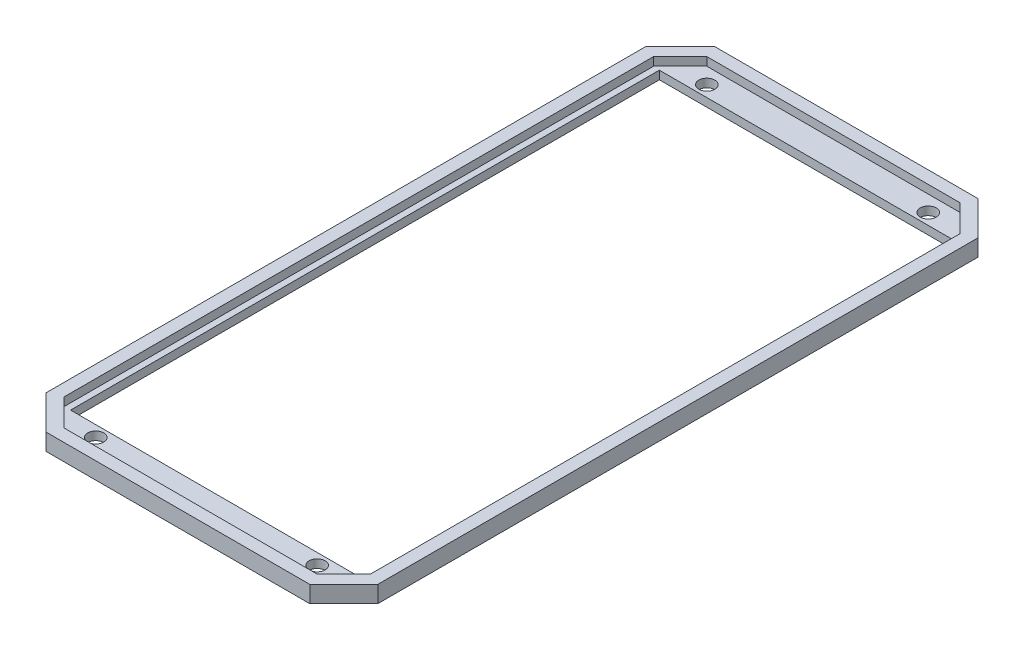
ISO-10303-21;
HEADER;
FILE_DESCRIPTION(('STEP AP214'),'2;1');
FILE_NAME('part.step','',(''),(''),'','','');
FILE_SCHEMA(('AUTOMOTIVE_DESIGN { 1 0 10303 214 1 1 1 1 }'));
ENDSEC;
DATA;
#1=APPLICATION_CONTEXT('core data for automotive mechanical design processes');
#2=APPLICATION_PROTOCOL_DEFINITION('international standard','automotive_design',2000,#1);
#3=PRODUCT_CONTEXT('',#1,'mechanical');
#4=PRODUCT('Part','Part','',(#3));
#5=PRODUCT_RELATED_PRODUCT_CATEGORY('part','',(#4));
#6=PRODUCT_DEFINITION_FORMATION('','',#4);
#7=PRODUCT_DEFINITION_CONTEXT('part definition',#1,'design');
#8=PRODUCT_DEFINITION('design','',#6,#7);
#9=PRODUCT_DEFINITION_SHAPE('','',#8);
#10=(LENGTH_UNIT() NAMED_UNIT(*) SI_UNIT(.MILLI.,.METRE.));
#11=(NAMED_UNIT(*) PLANE_ANGLE_UNIT() SI_UNIT($,.RADIAN.));
#12=(NAMED_UNIT(*) SI_UNIT($,.STERADIAN.) SOLID_ANGLE_UNIT());
#13=UNCERTAINTY_MEASURE_WITH_UNIT(LENGTH_MEASURE(1.E-05),#10,'distance_accuracy_value','');
#14=(GEOMETRIC_REPRESENTATION_CONTEXT(3) GLOBAL_UNCERTAINTY_ASSIGNED_CONTEXT((#13)) GLOBAL_UNIT_ASSIGNED_CONTEXT((#10,
#11,#12)) REPRESENTATION_CONTEXT('',''));
#15=CARTESIAN_POINT('',(0.,0.,0.));
#16=DIRECTION('',(0.,0.,1.));
#17=DIRECTION('',(1.,0.,0.));
#18=AXIS2_PLACEMENT_3D('',#15,#16,#17);
#19=CARTESIAN_POINT('',(-23.6494201824343,2.,15.549982511152));
#20=DIRECTION('',(-1.,0.,0.));
#21=DIRECTION('',(0.,0.,1.));
#22=AXIS2_PLACEMENT_3D('',#19,#20,#21);
#23=PLANE('',#22);
#24=DIRECTION('',(0.,0.,-1.));
#25=VECTOR('',#24,1.);
#26=CARTESIAN_POINT('',(-23.6494201824343,0.,15.549982511152));
#27=LINE('',#26,#25);
#28=CARTESIAN_POINT('',(-23.6494201824343,0.,85.7901944077587));
#29=VERTEX_POINT('',#28);
#30=CARTESIAN_POINT('',(-23.6494201824343,0.,-54.6831675743825));
#31=VERTEX_POINT('',#30);
#32=EDGE_CURVE('E317',#29,#31,#27,.T.);
#33=ORIENTED_EDGE('',*,*,#32,.F.);
#34=DIRECTION('',(0.,-1.,0.));
#35=VECTOR('',#34,1.);
#36=CARTESIAN_POINT('',(-23.6494201824343,2.,85.7901944077587));
#37=LINE('',#36,#35);
#38=CARTESIAN_POINT('',(-23.6494201824343,2.,85.7901944077587));
#39=VERTEX_POINT('',#38);
#40=EDGE_CURVE('E11',#39,#29,#37,.T.);
#41=ORIENTED_EDGE('',*,*,#40,.F.);
#42=DIRECTION('',(0.,0.,-1.));
#43=VECTOR('',#42,1.);
#44=CARTESIAN_POINT('',(-23.6494201824343,2.,15.549982511152));
#45=LINE('',#44,#43);
#46=CARTESIAN_POINT('',(-23.6494201824343,2.,-54.6831675743825));
#47=VERTEX_POINT('',#46);
#48=EDGE_CURVE('E277',#39,#47,#45,.T.);
#49=ORIENTED_EDGE('',*,*,#48,.T.);
#50=DIRECTION('',(0.,-1.,0.));
#51=VECTOR('',#50,1.);
#52=CARTESIAN_POINT('',(-23.6494201824343,2.,-54.6831675743825));
#53=LINE('',#52,#51);
#54=EDGE_CURVE('E334',#47,#31,#53,.T.);
#55=ORIENTED_EDGE('',*,*,#54,.T.);
#56=EDGE_LOOP('',(#33,#41,#49,#55));
#57=FACE_BOUND('',#56,.T.);
#58=ADVANCED_FACE('F32',(#57),#23,.T.);
#59=CARTESIAN_POINT('',(-197.311283367731,2.,85.7901944077588));
#60=DIRECTION('',(0.,0.,-1.));
#61=DIRECTION('',(-1.,0.,0.));
#62=AXIS2_PLACEMENT_3D('',#59,#60,#61);
#63=PLANE('',#62);
#64=DIRECTION('',(1.,0.,0.));
#65=VECTOR('',#64,1.);
#66=CARTESIAN_POINT('',(-197.311283367731,0.,85.7901944077588));
#67=LINE('',#66,#65);
#68=CARTESIAN_POINT('',(-93.8014202016012,0.,85.7901944077587));
#69=VERTEX_POINT('',#68);
#70=EDGE_CURVE('E320',#69,#29,#67,.T.);
#71=ORIENTED_EDGE('',*,*,#70,.F.);
#72=DIRECTION('',(0.,-1.,0.));
#73=VECTOR('',#72,1.);
#74=CARTESIAN_POINT('',(-93.8014202016012,2.,85.7901944077587));
#75=LINE('',#74,#73);
#76=CARTESIAN_POINT('',(-93.8014202016012,2.,85.7901944077587));
#77=VERTEX_POINT('',#76);
#78=EDGE_CURVE('E41',#77,#69,#75,.T.);
#79=ORIENTED_EDGE('',*,*,#78,.F.);
#80=DIRECTION('',(1.,0.,0.));
#81=VECTOR('',#80,1.);
#82=CARTESIAN_POINT('',(-197.311283367731,2.,85.7901944077588));
#83=LINE('',#82,#81);
#84=EDGE_CURVE('E280',#77,#39,#83,.T.);
#85=ORIENTED_EDGE('',*,*,#84,.T.);
#86=ORIENTED_EDGE('',*,*,#40,.T.);
#87=EDGE_LOOP('',(#71,#79,#85,#86));
#88=FACE_BOUND('',#87,.T.);
#89=ADVANCED_FACE('F406',(#88),#63,.T.);
#90=CARTESIAN_POINT('',(-93.8014202016012,2.,15.549982511152));
#91=DIRECTION('',(1.,0.,0.));
#92=DIRECTION('',(0.,0.,-1.));
#93=AXIS2_PLACEMENT_3D('',#90,#91,#92);
#94=PLANE('',#93);
#95=DIRECTION('',(0.,0.,1.));
#96=VECTOR('',#95,1.);
#97=CARTESIAN_POINT('',(-93.8014202016012,0.,15.549982511152));
#98=LINE('',#97,#96);
#99=CARTESIAN_POINT('',(-93.8014202016013,0.,-54.6831675743825));
#100=VERTEX_POINT('',#99);
#101=EDGE_CURVE('E323',#100,#69,#98,.T.);
#102=ORIENTED_EDGE('',*,*,#101,.F.);
#103=DIRECTION('',(0.,-1.,0.));
#104=VECTOR('',#103,1.);
#105=CARTESIAN_POINT('',(-93.8014202016013,2.,-54.6831675743825));
#106=LINE('',#105,#104);
#107=CARTESIAN_POINT('',(-93.8014202016013,2.,-54.6831675743825));
#108=VERTEX_POINT('',#107);
#109=EDGE_CURVE('E336',#108,#100,#106,.T.);
#110=ORIENTED_EDGE('',*,*,#109,.F.);
#111=DIRECTION('',(0.,0.,1.));
#112=VECTOR('',#111,1.);
#113=CARTESIAN_POINT('',(-93.8014202016012,2.,15.549982511152));
#114=LINE('',#113,#112);
#115=EDGE_CURVE('E283',#108,#77,#114,.T.);
#116=ORIENTED_EDGE('',*,*,#115,.T.);
#117=ORIENTED_EDGE('',*,*,#78,.T.);
#118=EDGE_LOOP('',(#102,#110,#116,#117));
#119=FACE_BOUND('',#118,.T.);
#120=ADVANCED_FACE('F412',(#119),#94,.T.);
#121=CARTESIAN_POINT('',(-197.311283367732,2.,-64.1615696298493));
#122=DIRECTION('',(0.,0.,1.));
#123=DIRECTION('',(1.,0.,0.));
#124=AXIS2_PLACEMENT_3D('',#121,#122,#123);
#125=PLANE('',#124);
#126=DIRECTION('',(-1.,0.,0.));
#127=VECTOR('',#126,1.);
#128=CARTESIAN_POINT('',(-197.311283367732,0.,-64.1615696298493));
#129=LINE('',#128,#127);
#130=CARTESIAN_POINT('',(-27.2567690802144,0.,-64.1615696298495));
#131=VERTEX_POINT('',#130);
#132=CARTESIAN_POINT('',(-90.1940659774526,0.,-64.1615696298494));
#133=VERTEX_POINT('',#132);
#134=EDGE_CURVE('E269',#131,#133,#129,.T.);
#135=ORIENTED_EDGE('',*,*,#134,.T.);
#136=DIRECTION('',(0.,-1.,0.));
#137=VECTOR('',#136,1.);
#138=CARTESIAN_POINT('',(-90.1940659774526,2.,-64.1615696298494));
#139=LINE('',#138,#137);
#140=CARTESIAN_POINT('',(-90.1940659774526,4.,-64.1615696298494));
#141=VERTEX_POINT('',#140);
#142=EDGE_CURVE('E36',#141,#133,#139,.T.);
#143=ORIENTED_EDGE('',*,*,#142,.F.);
#144=DIRECTION('',(-1.,0.,0.));
#145=VECTOR('',#144,1.);
#146=CARTESIAN_POINT('',(-197.311283367732,4.,-64.1615696298493));
#147=LINE('',#146,#145);
#148=CARTESIAN_POINT('',(-27.2567690802144,4.,-64.1615696298495));
#149=VERTEX_POINT('',#148);
#150=EDGE_CURVE('E210',#149,#141,#147,.T.);
#151=ORIENTED_EDGE('',*,*,#150,.F.);
#152=DIRECTION('',(0.,-1.,0.));
#153=VECTOR('',#152,1.);
#154=CARTESIAN_POINT('',(-27.2567690802144,2.,-64.1615696298495));
#155=LINE('',#154,#153);
#156=EDGE_CURVE('E294',#149,#131,#155,.T.);
#157=ORIENTED_EDGE('',*,*,#156,.T.);
#158=EDGE_LOOP('',(#135,#143,#151,#157));
#159=FACE_BOUND('',#158,.T.);
#160=ADVANCED_FACE('F34',(#159),#125,.F.);
#161=CARTESIAN_POINT('',(-183.561472634612,2.,29.2877420243397));
#162=DIRECTION('',(0.707416726024313,0.,0.706796700431632));
#163=DIRECTION('',(0.706796700431632,0.,-0.707416726024313));
#164=AXIS2_PLACEMENT_3D('',#161,#162,#163);
#165=PLANE('',#164);
#166=DIRECTION('',(-0.706796700431632,0.,0.707416726024313));
#167=VECTOR('',#166,1.);
#168=CARTESIAN_POINT('',(-183.561472634612,0.,29.2877420243397));
#169=LINE('',#168,#167);
#170=CARTESIAN_POINT('',(-98.3014227032664,0.,-56.0471008608471));
#171=VERTEX_POINT('',#170);
#172=EDGE_CURVE('E297',#133,#171,#169,.T.);
#173=ORIENTED_EDGE('',*,*,#172,.T.);
#174=DIRECTION('',(0.,-1.,0.));
#175=VECTOR('',#174,1.);
#176=CARTESIAN_POINT('',(-98.3014227032664,2.,-56.0471008608471));
#177=LINE('',#176,#175);
#178=CARTESIAN_POINT('',(-98.3014227032664,4.,-56.0471008608471));
#179=VERTEX_POINT('',#178);
#180=EDGE_CURVE('E355',#179,#171,#177,.T.);
#181=ORIENTED_EDGE('',*,*,#180,.F.);
#182=DIRECTION('',(-0.706796700431632,0.,0.707416726024313));
#183=VECTOR('',#182,1.);
#184=CARTESIAN_POINT('',(-183.561472634612,4.,29.2877420243397));
#185=LINE('',#184,#183);
#186=EDGE_CURVE('E213',#141,#179,#185,.T.);
#187=ORIENTED_EDGE('',*,*,#186,.F.);
#188=ORIENTED_EDGE('',*,*,#142,.T.);
#189=EDGE_LOOP('',(#173,#181,#187,#188));
#190=FACE_BOUND('',#189,.T.);
#191=ADVANCED_FACE('F363',(#190),#165,.F.);
#192=CARTESIAN_POINT('',(-98.3014227032664,2.,15.549982511152));
#193=DIRECTION('',(1.,0.,0.));
#194=DIRECTION('',(0.,0.,-1.));
#195=AXIS2_PLACEMENT_3D('',#192,#193,#194);
#196=PLANE('',#195);
#197=DIRECTION('',(0.,0.,1.));
#198=VECTOR('',#197,1.);
#199=CARTESIAN_POINT('',(-98.3014227032664,0.,15.549982511152));
#200=LINE('',#199,#198);
#201=CARTESIAN_POINT('',(-98.3014227032664,0.,87.1541805133933));
#202=VERTEX_POINT('',#201);
#203=EDGE_CURVE('E299',#171,#202,#200,.T.);
#204=ORIENTED_EDGE('',*,*,#203,.T.);
#205=DIRECTION('',(0.,-1.,0.));
#206=VECTOR('',#205,1.);
#207=CARTESIAN_POINT('',(-98.3014227032664,2.,87.1541805133933));
#208=LINE('',#207,#206);
#209=CARTESIAN_POINT('',(-98.3014227032664,4.,87.1541805133933));
#210=VERTEX_POINT('',#209);
#211=EDGE_CURVE('E353',#210,#202,#208,.T.);
#212=ORIENTED_EDGE('',*,*,#211,.F.);
#213=DIRECTION('',(0.,0.,1.));
#214=VECTOR('',#213,1.);
#215=CARTESIAN_POINT('',(-98.3014227032664,4.,15.549982511152));
#216=LINE('',#215,#214);
#217=EDGE_CURVE('E216',#179,#210,#216,.T.);
#218=ORIENTED_EDGE('',*,*,#217,.F.);
#219=ORIENTED_EDGE('',*,*,#180,.T.);
#220=EDGE_LOOP('',(#204,#212,#218,#219));
#221=FACE_BOUND('',#220,.T.);
#222=ADVANCED_FACE('F373',(#221),#196,.F.);
#223=CARTESIAN_POINT('',(-183.608515224739,2.,1.84719687791989));
#224=DIRECTION('',(0.707106329910458,0.,-0.707107232462349));
#225=DIRECTION('',(-0.707107232462349,0.,-0.707106329910458));
#226=AXIS2_PLACEMENT_3D('',#223,#224,#225);
#227=PLANE('',#226);
#228=DIRECTION('',(0.707107232462349,0.,0.707106329910458));
#229=VECTOR('',#228,1.);
#230=CARTESIAN_POINT('',(-183.608515224739,0.,1.84719687791989));
#231=LINE('',#230,#229);
#232=CARTESIAN_POINT('',(-90.1940582162637,0.,95.2615346521534));
#233=VERTEX_POINT('',#232);
#234=EDGE_CURVE('E301',#202,#233,#231,.T.);
#235=ORIENTED_EDGE('',*,*,#234,.T.);
#236=DIRECTION('',(0.,-1.,0.));
#237=VECTOR('',#236,1.);
#238=CARTESIAN_POINT('',(-90.1940582162637,2.,95.2615346521534));
#239=LINE('',#238,#237);
#240=CARTESIAN_POINT('',(-90.1940582162637,4.,95.2615346521534));
#241=VERTEX_POINT('',#240);
#242=EDGE_CURVE('E350',#241,#233,#239,.T.);
#243=ORIENTED_EDGE('',*,*,#242,.F.);
#244=DIRECTION('',(0.707107232462349,0.,0.707106329910458));
#245=VECTOR('',#244,1.);
#246=CARTESIAN_POINT('',(-183.608515224739,4.,1.84719687791989));
#247=LINE('',#246,#245);
#248=EDGE_CURVE('E219',#210,#241,#247,.T.);
#249=ORIENTED_EDGE('',*,*,#248,.F.);
#250=ORIENTED_EDGE('',*,*,#211,.T.);
#251=EDGE_LOOP('',(#235,#243,#249,#250));
#252=FACE_BOUND('',#251,.T.);
#253=ADVANCED_FACE('F376',(#252),#227,.F.);
#254=CARTESIAN_POINT('',(-197.311283367731,2.,95.2615346521535));
#255=DIRECTION('',(0.,0.,-1.));
#256=DIRECTION('',(-1.,0.,0.));
#257=AXIS2_PLACEMENT_3D('',#254,#255,#256);
#258=PLANE('',#257);
#259=DIRECTION('',(1.,0.,0.));
#260=VECTOR('',#259,1.);
#261=CARTESIAN_POINT('',(-197.311283367731,0.,95.2615346521535));
#262=LINE('',#261,#260);
#263=CARTESIAN_POINT('',(-27.2567768418157,0.,95.2615346521534));
#264=VERTEX_POINT('',#263);
#265=EDGE_CURVE('E303',#233,#264,#262,.T.);
#266=ORIENTED_EDGE('',*,*,#265,.T.);
#267=DIRECTION('',(0.,-1.,0.));
#268=VECTOR('',#267,1.);
#269=CARTESIAN_POINT('',(-27.2567768418157,2.,95.2615346521534));
#270=LINE('',#269,#268);
#271=CARTESIAN_POINT('',(-27.2567768418157,4.,95.2615346521534));
#272=VERTEX_POINT('',#271);
#273=EDGE_CURVE('E347',#272,#264,#270,.T.);
#274=ORIENTED_EDGE('',*,*,#273,.F.);
#275=DIRECTION('',(1.,0.,0.));
#276=VECTOR('',#275,1.);
#277=CARTESIAN_POINT('',(-197.311283367731,4.,95.2615346521535));
#278=LINE('',#277,#276);
#279=EDGE_CURVE('E222',#241,#272,#278,.T.);
#280=ORIENTED_EDGE('',*,*,#279,.F.);
#281=ORIENTED_EDGE('',*,*,#242,.T.);
#282=EDGE_LOOP('',(#266,#274,#280,#281));
#283=FACE_BOUND('',#282,.T.);
#284=ADVANCED_FACE('F380',(#283),#258,.F.);
#285=CARTESIAN_POINT('',(-72.4285189262058,2.,140.433136009868));
#286=DIRECTION('',(-0.70710567973446,0.,-0.707107882636919));
#287=DIRECTION('',(-0.707107882636919,0.,0.70710567973446));
#288=AXIS2_PLACEMENT_3D('',#285,#286,#287);
#289=PLANE('',#288);
#290=DIRECTION('',(0.707107882636919,0.,-0.70710567973446));
#291=VECTOR('',#290,1.);
#292=CARTESIAN_POINT('',(-72.4285189262058,0.,140.433136009868));
#293=LINE('',#292,#291);
#294=CARTESIAN_POINT('',(-19.1494175289392,0.,87.1542005966983));
#295=VERTEX_POINT('',#294);
#296=EDGE_CURVE('E305',#264,#295,#293,.T.);
#297=ORIENTED_EDGE('',*,*,#296,.T.);
#298=DIRECTION('',(0.,-1.,0.));
#299=VECTOR('',#298,1.);
#300=CARTESIAN_POINT('',(-19.1494175289392,2.,87.1542005966983));
#301=LINE('',#300,#299);
#302=CARTESIAN_POINT('',(-19.1494175289392,4.,87.1542005966983));
#303=VERTEX_POINT('',#302);
#304=EDGE_CURVE('E344',#303,#295,#301,.T.);
#305=ORIENTED_EDGE('',*,*,#304,.F.);
#306=DIRECTION('',(0.707107882636919,0.,-0.70710567973446));
#307=VECTOR('',#306,1.);
#308=CARTESIAN_POINT('',(-72.4285189262058,4.,140.433136009868));
#309=LINE('',#308,#307);
#310=EDGE_CURVE('E225',#272,#303,#309,.T.);
#311=ORIENTED_EDGE('',*,*,#310,.F.);
#312=ORIENTED_EDGE('',*,*,#273,.T.);
#313=EDGE_LOOP('',(#297,#305,#311,#312));
#314=FACE_BOUND('',#313,.T.);
#315=ADVANCED_FACE('F383',(#314),#289,.F.);
#316=CARTESIAN_POINT('',(-19.1494175289392,2.,15.549982511152));
#317=DIRECTION('',(-1.,0.,0.));
#318=DIRECTION('',(0.,0.,1.));
#319=AXIS2_PLACEMENT_3D('',#316,#317,#318);
#320=PLANE('',#319);
#321=DIRECTION('',(0.,0.,-1.));
#322=VECTOR('',#321,1.);
#323=CARTESIAN_POINT('',(-19.1494175289392,0.,15.549982511152));
#324=LINE('',#323,#322);
#325=CARTESIAN_POINT('',(-19.1494175289392,0.,-56.0470807775425));
#326=VERTEX_POINT('',#325);
#327=EDGE_CURVE('E307',#295,#326,#324,.T.);
#328=ORIENTED_EDGE('',*,*,#327,.T.);
#329=DIRECTION('',(0.,-1.,0.));
#330=VECTOR('',#329,1.);
#331=CARTESIAN_POINT('',(-19.1494175289392,2.,-56.0470807775425));
#332=LINE('',#331,#330);
#333=CARTESIAN_POINT('',(-19.1494175289392,4.,-56.0470807775425));
#334=VERTEX_POINT('',#333);
#335=EDGE_CURVE('E341',#334,#326,#332,.T.);
#336=ORIENTED_EDGE('',*,*,#335,.F.);
#337=DIRECTION('',(0.,0.,-1.));
#338=VECTOR('',#337,1.);
#339=CARTESIAN_POINT('',(-19.1494175289392,4.,15.549982511152));
#340=LINE('',#339,#338);
#341=EDGE_CURVE('E228',#303,#334,#340,.T.);
#342=ORIENTED_EDGE('',*,*,#341,.F.);
#343=ORIENTED_EDGE('',*,*,#304,.T.);
#344=EDGE_LOOP('',(#328,#336,#342,#343));
#345=FACE_BOUND('',#344,.T.);
#346=ADVANCED_FACE('F385',(#345),#320,.F.);
#347=CARTESIAN_POINT('',(-32.309420182434,2.,88.451514751311));
#348=DIRECTION('',(0.,-1.,0.));
#349=DIRECTION('',(0.,0.,-1.));
#350=AXIS2_PLACEMENT_3D('',#347,#348,#349);
#351=CYLINDRICAL_SURFACE('',#350,1.9049999999988);
#352=CARTESIAN_POINT('',(-32.309420182434,2.,88.451514751311));
#353=DIRECTION('',(0.,1.,0.));
#354=DIRECTION('',(0.,0.,1.));
#355=AXIS2_PLACEMENT_3D('',#352,#353,#354);
#356=CIRCLE('',#355,1.9049999999988);
#357=CARTESIAN_POINT('',(-32.309420182434,2.,90.3565147513098));
#358=VERTEX_POINT('',#357);
#359=EDGE_CURVE('E288',#358,#358,#356,.F.);
#360=ORIENTED_EDGE('',*,*,#359,.F.);
#361=EDGE_LOOP('',(#360));
#362=FACE_BOUND('',#361,.T.);
#363=CARTESIAN_POINT('',(-32.309420182434,0.,88.451514751311));
#364=DIRECTION('',(0.,1.,0.));
#365=DIRECTION('',(0.,0.,1.));
#366=AXIS2_PLACEMENT_3D('',#363,#364,#365);
#367=CIRCLE('',#366,1.9049999999988);
#368=CARTESIAN_POINT('',(-32.309420182434,0.,90.3565147513098));
#369=VERTEX_POINT('',#368);
#370=EDGE_CURVE('E329',#369,#369,#367,.F.);
#371=ORIENTED_EDGE('',*,*,#370,.T.);
#372=EDGE_LOOP('',(#371));
#373=FACE_BOUND('',#372,.T.);
#374=ADVANCED_FACE('F424',(#362,#373),#351,.F.);
#375=CARTESIAN_POINT('',(-197.311283367731,2.,-54.6831675743824));
#376=DIRECTION('',(0.,0.,-1.));
#377=DIRECTION('',(-1.,0.,0.));
#378=AXIS2_PLACEMENT_3D('',#375,#376,#377);
#379=PLANE('',#378);
#380=DIRECTION('',(1.,0.,0.));
#381=VECTOR('',#380,1.);
#382=CARTESIAN_POINT('',(-197.311283367731,0.,-54.6831675743824));
#383=LINE('',#382,#381);
#384=EDGE_CURVE('E326',#100,#31,#383,.T.);
#385=ORIENTED_EDGE('',*,*,#384,.T.);
#386=ORIENTED_EDGE('',*,*,#54,.F.);
#387=DIRECTION('',(1.,0.,0.));
#388=VECTOR('',#387,1.);
#389=CARTESIAN_POINT('',(-197.311283367731,2.,-54.6831675743824));
#390=LINE('',#389,#388);
#391=EDGE_CURVE('E286',#108,#47,#390,.T.);
#392=ORIENTED_EDGE('',*,*,#391,.F.);
#393=ORIENTED_EDGE('',*,*,#109,.T.);
#394=EDGE_LOOP('',(#385,#386,#392,#393));
#395=FACE_BOUND('',#394,.T.);
#396=ADVANCED_FACE('F419',(#395),#379,.F.);
#397=CARTESIAN_POINT('',(-85.1414201824341,2.,88.451514751311));
#398=DIRECTION('',(0.,-1.,0.));
#399=DIRECTION('',(0.,0.,-1.));
#400=AXIS2_PLACEMENT_3D('',#397,#398,#399);
#401=CYLINDRICAL_SURFACE('',#400,1.90500000000017);
#402=CARTESIAN_POINT('',(-85.1414201824341,2.,88.451514751311));
#403=DIRECTION('',(0.,1.,0.));
#404=DIRECTION('',(0.,0.,1.));
#405=AXIS2_PLACEMENT_3D('',#402,#403,#404);
#406=CIRCLE('',#405,1.90500000000017);
#407=CARTESIAN_POINT('',(-85.1414201824341,2.,90.3565147513112));
#408=VERTEX_POINT('',#407);
#409=EDGE_CURVE('E273',#408,#408,#406,.F.);
#410=ORIENTED_EDGE('',*,*,#409,.F.);
#411=EDGE_LOOP('',(#410));
#412=FACE_BOUND('',#411,.T.);
#413=CARTESIAN_POINT('',(-85.1414201824341,0.,88.451514751311));
#414=DIRECTION('',(0.,1.,0.));
#415=DIRECTION('',(0.,0.,1.));
#416=AXIS2_PLACEMENT_3D('',#413,#414,#415);
#417=CIRCLE('',#416,1.90500000000017);
#418=CARTESIAN_POINT('',(-85.1414201824341,0.,90.3565147513112));
#419=VERTEX_POINT('',#418);
#420=EDGE_CURVE('E314',#419,#419,#417,.F.);
#421=ORIENTED_EDGE('',*,*,#420,.T.);
#422=EDGE_LOOP('',(#421));
#423=FACE_BOUND('',#422,.T.);
#424=ADVANCED_FACE('F401',(#412,#423),#401,.F.);
#425=CARTESIAN_POINT('',(-32.3094201824324,2.,-57.3444852486838));
#426=DIRECTION('',(0.,-1.,0.));
#427=DIRECTION('',(0.,0.,-1.));
#428=AXIS2_PLACEMENT_3D('',#425,#426,#427);
#429=CYLINDRICAL_SURFACE('',#428,1.90499999999994);
#430=CARTESIAN_POINT('',(-32.3094201824324,2.,-57.3444852486838));
#431=DIRECTION('',(0.,1.,0.));
#432=DIRECTION('',(0.,0.,1.));
#433=AXIS2_PLACEMENT_3D('',#430,#431,#432);
#434=CIRCLE('',#433,1.90499999999994);
#435=CARTESIAN_POINT('',(-32.3094201824324,2.,-55.4394852486838));
#436=VERTEX_POINT('',#435);
#437=EDGE_CURVE('E270',#436,#436,#434,.F.);
#438=ORIENTED_EDGE('',*,*,#437,.F.);
#439=EDGE_LOOP('',(#438));
#440=FACE_BOUND('',#439,.T.);
#441=CARTESIAN_POINT('',(-32.3094201824324,0.,-57.3444852486838));
#442=DIRECTION('',(0.,1.,0.));
#443=DIRECTION('',(0.,0.,1.));
#444=AXIS2_PLACEMENT_3D('',#441,#442,#443);
#445=CIRCLE('',#444,1.90499999999994);
#446=CARTESIAN_POINT('',(-32.3094201824324,0.,-55.4394852486838));
#447=VERTEX_POINT('',#446);
#448=EDGE_CURVE('E311',#447,#447,#445,.F.);
#449=ORIENTED_EDGE('',*,*,#448,.T.);
#450=EDGE_LOOP('',(#449));
#451=FACE_BOUND('',#450,.T.);
#452=ADVANCED_FACE('F392',(#440,#451),#429,.F.);
#453=CARTESIAN_POINT('',(-72.3534448490883,2.,-109.297946224383));
#454=DIRECTION('',(-0.707417826239985,0.,0.7067955992491));
#455=DIRECTION('',(0.7067955992491,0.,0.707417826239985));
#456=AXIS2_PLACEMENT_3D('',#453,#454,#455);
#457=PLANE('',#456);
#458=DIRECTION('',(-0.7067955992491,0.,-0.707417826239985));
#459=VECTOR('',#458,1.);
#460=CARTESIAN_POINT('',(-72.3534448490883,0.,-109.297946224383));
#461=LINE('',#460,#459);
#462=EDGE_CURVE('E309',#326,#131,#461,.T.);
#463=ORIENTED_EDGE('',*,*,#462,.T.);
#464=ORIENTED_EDGE('',*,*,#156,.F.);
#465=DIRECTION('',(-0.7067955992491,0.,-0.707417826239985));
#466=VECTOR('',#465,1.);
#467=CARTESIAN_POINT('',(-72.3534448490883,4.,-109.297946224383));
#468=LINE('',#467,#466);
#469=EDGE_CURVE('E231',#334,#149,#468,.T.);
#470=ORIENTED_EDGE('',*,*,#469,.F.);
#471=ORIENTED_EDGE('',*,*,#335,.T.);
#472=EDGE_LOOP('',(#463,#464,#470,#471));
#473=FACE_BOUND('',#472,.T.);
#474=ADVANCED_FACE('F389',(#473),#457,.F.);
#475=CARTESIAN_POINT('',(-85.1414201824327,2.,-57.3444852486844));
#476=DIRECTION('',(0.,-1.,0.));
#477=DIRECTION('',(0.,0.,-1.));
#478=AXIS2_PLACEMENT_3D('',#475,#476,#477);
#479=CYLINDRICAL_SURFACE('',#478,1.90499999999936);
#480=CARTESIAN_POINT('',(-85.1414201824327,2.,-57.3444852486844));
#481=DIRECTION('',(0.,1.,0.));
#482=DIRECTION('',(0.,0.,1.));
#483=AXIS2_PLACEMENT_3D('',#480,#481,#482);
#484=CIRCLE('',#483,1.90499999999936);
#485=CARTESIAN_POINT('',(-85.1414201824327,2.,-55.4394852486851));
#486=VERTEX_POINT('',#485);
#487=EDGE_CURVE('E291',#486,#486,#484,.F.);
#488=ORIENTED_EDGE('',*,*,#487,.F.);
#489=EDGE_LOOP('',(#488));
#490=FACE_BOUND('',#489,.T.);
#491=CARTESIAN_POINT('',(-85.1414201824327,0.,-57.3444852486844));
#492=DIRECTION('',(0.,1.,0.));
#493=DIRECTION('',(0.,0.,1.));
#494=AXIS2_PLACEMENT_3D('',#491,#492,#493);
#495=CIRCLE('',#494,1.90499999999936);
#496=CARTESIAN_POINT('',(-85.1414201824327,0.,-55.4394852486851));
#497=VERTEX_POINT('',#496);
#498=EDGE_CURVE('E274',#497,#497,#495,.F.);
#499=ORIENTED_EDGE('',*,*,#498,.T.);
#500=EDGE_LOOP('',(#499));
#501=FACE_BOUND('',#500,.T.);
#502=ADVANCED_FACE('F391',(#490,#501),#479,.F.);
#503=CARTESIAN_POINT('',(-197.311283367731,2.,15.549982511152));
#504=DIRECTION('',(0.,1.,0.));
#505=DIRECTION('',(0.,0.,1.));
#506=AXIS2_PLACEMENT_3D('',#503,#504,#505);
#507=PLANE('',#506);
#508=DIRECTION('',(0.707104633128759,0.,-0.70710892923781));
#509=VECTOR('',#508,1.);
#510=CARTESIAN_POINT('',(-181.483275768094,2.,31.3778939461903));
#511=LINE('',#510,#509);
#512=CARTESIAN_POINT('',(-95.3014201826442,2.,-54.8044852486838));
#513=VERTEX_POINT('',#512);
#514=CARTESIAN_POINT('',(-88.9514380977706,2.,-61.1545059137253));
#515=VERTEX_POINT('',#514);
#516=EDGE_CURVE('E174',#513,#515,#511,.T.);
#517=ORIENTED_EDGE('',*,*,#516,.F.);
#518=DIRECTION('',(0.,0.,-1.));
#519=VECTOR('',#518,1.);
#520=CARTESIAN_POINT('',(-95.3014201826442,2.,15.549982511152));
#521=LINE('',#520,#519);
#522=CARTESIAN_POINT('',(-95.3014201826442,2.,85.9115147513184));
#523=VERTEX_POINT('',#522);
#524=EDGE_CURVE('E177',#523,#513,#521,.T.);
#525=ORIENTED_EDGE('',*,*,#524,.F.);
#526=DIRECTION('',(-0.707106781186548,0.,-0.707106781186548));
#527=VECTOR('',#526,1.);
#528=CARTESIAN_POINT('',(-181.487117895271,2.,-0.274182961308484));
#529=LINE('',#528,#527);
#530=CARTESIAN_POINT('',(-88.9514201826461,2.,92.2615147513164));
#531=VERTEX_POINT('',#530);
#532=EDGE_CURVE('E254',#531,#523,#529,.T.);
#533=ORIENTED_EDGE('',*,*,#532,.F.);
#534=DIRECTION('',(-1.,0.,0.));
#535=VECTOR('',#534,1.);
#536=CARTESIAN_POINT('',(-197.311283367731,2.,92.2615147513165));
#537=LINE('',#536,#535);
#538=CARTESIAN_POINT('',(-28.4994201824342,2.,92.2615147513164));
#539=VERTEX_POINT('',#538);
#540=EDGE_CURVE('E257',#539,#531,#537,.T.);
#541=ORIENTED_EDGE('',*,*,#540,.F.);
#542=DIRECTION('',(-0.707109380538421,0.,0.707104181825118));
#543=VECTOR('',#542,1.);
#544=CARTESIAN_POINT('',(-74.5502062161154,2.,138.311962216679));
#545=LINE('',#544,#543);
#546=CARTESIAN_POINT('',(-22.1494161298744,2.,85.9115573843917));
#547=VERTEX_POINT('',#546);
#548=EDGE_CURVE('E260',#547,#539,#545,.T.);
#549=ORIENTED_EDGE('',*,*,#548,.F.);
#550=DIRECTION('',(0.,0.,1.));
#551=VECTOR('',#550,1.);
#552=CARTESIAN_POINT('',(-22.1494161298744,2.,15.549982511152));
#553=LINE('',#552,#551);
#554=CARTESIAN_POINT('',(-22.1494161298744,2.,-54.8044426156085));
#555=VERTEX_POINT('',#554);
#556=EDGE_CURVE('E263',#555,#547,#553,.T.);
#557=ORIENTED_EDGE('',*,*,#556,.F.);
#558=DIRECTION('',(0.707114857515329,0.,0.70709870476552));
#559=VECTOR('',#558,1.);
#560=CARTESIAN_POINT('',(-74.5551378442146,2.,-107.208967216775));
#561=LINE('',#560,#559);
#562=CARTESIAN_POINT('',(-28.4996244869244,2.,-61.1545059137254));
#563=VERTEX_POINT('',#562);
#564=EDGE_CURVE('E54',#563,#555,#561,.T.);
#565=ORIENTED_EDGE('',*,*,#564,.F.);
#566=DIRECTION('',(1.,0.,0.));
#567=VECTOR('',#566,1.);
#568=CARTESIAN_POINT('',(-197.311283367731,2.,-61.1545059137252));
#569=LINE('',#568,#567);
#570=EDGE_CURVE('E49',#515,#563,#569,.T.);
#571=ORIENTED_EDGE('',*,*,#570,.F.);
#572=EDGE_LOOP('',(#517,#525,#533,#541,#549,#557,#565,#571));
#573=FACE_BOUND('',#572,.T.);
#574=ORIENTED_EDGE('',*,*,#437,.T.);
#575=EDGE_LOOP('',(#574));
#576=FACE_BOUND('',#575,.T.);
#577=ORIENTED_EDGE('',*,*,#409,.T.);
#578=EDGE_LOOP('',(#577));
#579=FACE_BOUND('',#578,.T.);
#580=ORIENTED_EDGE('',*,*,#48,.F.);
#581=ORIENTED_EDGE('',*,*,#84,.F.);
#582=ORIENTED_EDGE('',*,*,#115,.F.);
#583=ORIENTED_EDGE('',*,*,#391,.T.);
#584=EDGE_LOOP('',(#580,#581,#582,#583));
#585=FACE_BOUND('',#584,.T.);
#586=ORIENTED_EDGE('',*,*,#359,.T.);
#587=EDGE_LOOP('',(#586));
#588=FACE_BOUND('',#587,.T.);
#589=ORIENTED_EDGE('',*,*,#487,.T.);
#590=EDGE_LOOP('',(#589));
#591=FACE_BOUND('',#590,.T.);
#592=ADVANCED_FACE('F398',(#573,#576,#579,#585,#588,#591),#507,.T.);
#593=CARTESIAN_POINT('',(-197.311283367731,0.,15.549982511152));
#594=DIRECTION('',(0.,1.,0.));
#595=DIRECTION('',(0.,0.,1.));
#596=AXIS2_PLACEMENT_3D('',#593,#594,#595);
#597=PLANE('',#596);
#598=ORIENTED_EDGE('',*,*,#448,.F.);
#599=EDGE_LOOP('',(#598));
#600=FACE_BOUND('',#599,.T.);
#601=ORIENTED_EDGE('',*,*,#420,.F.);
#602=EDGE_LOOP('',(#601));
#603=FACE_BOUND('',#602,.T.);
#604=ORIENTED_EDGE('',*,*,#32,.T.);
#605=ORIENTED_EDGE('',*,*,#384,.F.);
#606=ORIENTED_EDGE('',*,*,#101,.T.);
#607=ORIENTED_EDGE('',*,*,#70,.T.);
#608=EDGE_LOOP('',(#604,#605,#606,#607));
#609=FACE_BOUND('',#608,.T.);
#610=ORIENTED_EDGE('',*,*,#370,.F.);
#611=EDGE_LOOP('',(#610));
#612=FACE_BOUND('',#611,.T.);
#613=ORIENTED_EDGE('',*,*,#498,.F.);
#614=EDGE_LOOP('',(#613));
#615=FACE_BOUND('',#614,.T.);
#616=ORIENTED_EDGE('',*,*,#134,.F.);
#617=ORIENTED_EDGE('',*,*,#462,.F.);
#618=ORIENTED_EDGE('',*,*,#327,.F.);
#619=ORIENTED_EDGE('',*,*,#296,.F.);
#620=ORIENTED_EDGE('',*,*,#265,.F.);
#621=ORIENTED_EDGE('',*,*,#234,.F.);
#622=ORIENTED_EDGE('',*,*,#203,.F.);
#623=ORIENTED_EDGE('',*,*,#172,.F.);
#624=EDGE_LOOP('',(#616,#617,#618,#619,#620,#621,#622,#623));
#625=FACE_BOUND('',#624,.T.);
#626=ADVANCED_FACE('F369',(#600,#603,#609,#612,#615,#625),#597,.F.);
#627=CARTESIAN_POINT('',(-181.483275768094,4.,31.3778939461903));
#628=DIRECTION('',(0.70710892923781,0.,0.707104633128759));
#629=DIRECTION('',(0.707104633128759,0.,-0.70710892923781));
#630=AXIS2_PLACEMENT_3D('',#627,#628,#629);
#631=PLANE('',#630);
#632=DIRECTION('',(0.,-1.,0.));
#633=VECTOR('',#632,1.);
#634=CARTESIAN_POINT('',(-95.3014201826442,4.,-54.8044852486838));
#635=LINE('',#634,#633);
#636=CARTESIAN_POINT('',(-95.3014201826442,4.,-54.8044852486838));
#637=VERTEX_POINT('',#636);
#638=EDGE_CURVE('E234',#637,#513,#635,.T.);
#639=ORIENTED_EDGE('',*,*,#638,.T.);
#640=ORIENTED_EDGE('',*,*,#516,.T.);
#641=DIRECTION('',(0.,-1.,0.));
#642=VECTOR('',#641,1.);
#643=CARTESIAN_POINT('',(-88.9514380977706,4.,-61.1545059137253));
#644=LINE('',#643,#642);
#645=CARTESIAN_POINT('',(-88.9514380977706,4.,-61.1545059137253));
#646=VERTEX_POINT('',#645);
#647=EDGE_CURVE('E168',#646,#515,#644,.T.);
#648=ORIENTED_EDGE('',*,*,#647,.F.);
#649=DIRECTION('',(-0.707104633128759,0.,0.70710892923781));
#650=VECTOR('',#649,1.);
#651=CARTESIAN_POINT('',(-181.483275768094,4.,31.3778939461903));
#652=LINE('',#651,#650);
#653=EDGE_CURVE('E172',#646,#637,#652,.T.);
#654=ORIENTED_EDGE('',*,*,#653,.T.);
#655=EDGE_LOOP('',(#639,#640,#648,#654));
#656=FACE_BOUND('',#655,.T.);
#657=ADVANCED_FACE('F171',(#656),#631,.T.);
#658=CARTESIAN_POINT('',(-197.311283367731,4.,-61.1545059137252));
#659=DIRECTION('',(0.,0.,1.));
#660=DIRECTION('',(1.,0.,0.));
#661=AXIS2_PLACEMENT_3D('',#658,#659,#660);
#662=PLANE('',#661);
#663=ORIENTED_EDGE('',*,*,#647,.T.);
#664=ORIENTED_EDGE('',*,*,#570,.T.);
#665=DIRECTION('',(0.,-1.,0.));
#666=VECTOR('',#665,1.);
#667=CARTESIAN_POINT('',(-28.4996244869244,4.,-61.1545059137253));
#668=LINE('',#667,#666);
#669=CARTESIAN_POINT('',(-28.4996244869244,4.,-61.1545059137253));
#670=VERTEX_POINT('',#669);
#671=EDGE_CURVE('E178',#670,#563,#668,.T.);
#672=ORIENTED_EDGE('',*,*,#671,.F.);
#673=DIRECTION('',(-1.,0.,0.));
#674=VECTOR('',#673,1.);
#675=CARTESIAN_POINT('',(-197.311283367731,4.,-61.1545059137252));
#676=LINE('',#675,#674);
#677=EDGE_CURVE('E185',#670,#646,#676,.T.);
#678=ORIENTED_EDGE('',*,*,#677,.T.);
#679=EDGE_LOOP('',(#663,#664,#672,#678));
#680=FACE_BOUND('',#679,.T.);
#681=ADVANCED_FACE('F191',(#680),#662,.T.);
#682=CARTESIAN_POINT('',(-74.5551378442147,4.,-107.208967216775));
#683=DIRECTION('',(-0.70709870476552,0.,0.707114857515329));
#684=DIRECTION('',(0.707114857515329,0.,0.70709870476552));
#685=AXIS2_PLACEMENT_3D('',#682,#683,#684);
#686=PLANE('',#685);
#687=ORIENTED_EDGE('',*,*,#671,.T.);
#688=ORIENTED_EDGE('',*,*,#564,.T.);
#689=DIRECTION('',(0.,-1.,0.));
#690=VECTOR('',#689,1.);
#691=CARTESIAN_POINT('',(-22.1494161298744,4.,-54.8044426156085));
#692=LINE('',#691,#690);
#693=CARTESIAN_POINT('',(-22.1494161298744,4.,-54.8044426156085));
#694=VERTEX_POINT('',#693);
#695=EDGE_CURVE('E248',#694,#555,#692,.T.);
#696=ORIENTED_EDGE('',*,*,#695,.F.);
#697=DIRECTION('',(-0.707114857515329,0.,-0.70709870476552));
#698=VECTOR('',#697,1.);
#699=CARTESIAN_POINT('',(-74.5551378442147,4.,-107.208967216775));
#700=LINE('',#699,#698);
#701=EDGE_CURVE('E193',#694,#670,#700,.T.);
#702=ORIENTED_EDGE('',*,*,#701,.T.);
#703=EDGE_LOOP('',(#687,#688,#696,#702));
#704=FACE_BOUND('',#703,.T.);
#705=ADVANCED_FACE('F475',(#704),#686,.T.);
#706=CARTESIAN_POINT('',(-22.1494161298744,4.,15.549982511152));
#707=DIRECTION('',(-1.,0.,0.));
#708=DIRECTION('',(0.,0.,1.));
#709=AXIS2_PLACEMENT_3D('',#706,#707,#708);
#710=PLANE('',#709);
#711=ORIENTED_EDGE('',*,*,#695,.T.);
#712=ORIENTED_EDGE('',*,*,#556,.T.);
#713=DIRECTION('',(0.,-1.,0.));
#714=VECTOR('',#713,1.);
#715=CARTESIAN_POINT('',(-22.1494161298744,4.,85.9115573843917));
#716=LINE('',#715,#714);
#717=CARTESIAN_POINT('',(-22.1494161298744,4.,85.9115573843917));
#718=VERTEX_POINT('',#717);
#719=EDGE_CURVE('E245',#718,#547,#716,.T.);
#720=ORIENTED_EDGE('',*,*,#719,.F.);
#721=DIRECTION('',(0.,0.,-1.));
#722=VECTOR('',#721,1.);
#723=CARTESIAN_POINT('',(-22.1494161298744,4.,15.549982511152));
#724=LINE('',#723,#722);
#725=EDGE_CURVE('E195',#718,#694,#724,.T.);
#726=ORIENTED_EDGE('',*,*,#725,.T.);
#727=EDGE_LOOP('',(#711,#712,#720,#726));
#728=FACE_BOUND('',#727,.T.);
#729=ADVANCED_FACE('F478',(#728),#710,.T.);
#730=CARTESIAN_POINT('',(-74.5502062161154,4.,138.311962216679));
#731=DIRECTION('',(-0.707104181825118,0.,-0.707109380538421));
#732=DIRECTION('',(-0.707109380538421,0.,0.707104181825118));
#733=AXIS2_PLACEMENT_3D('',#730,#731,#732);
#734=PLANE('',#733);
#735=ORIENTED_EDGE('',*,*,#719,.T.);
#736=ORIENTED_EDGE('',*,*,#548,.T.);
#737=DIRECTION('',(0.,-1.,0.));
#738=VECTOR('',#737,1.);
#739=CARTESIAN_POINT('',(-28.4994201824342,4.,92.2615147513164));
#740=LINE('',#739,#738);
#741=CARTESIAN_POINT('',(-28.4994201824342,4.,92.2615147513164));
#742=VERTEX_POINT('',#741);
#743=EDGE_CURVE('E242',#742,#539,#740,.T.);
#744=ORIENTED_EDGE('',*,*,#743,.F.);
#745=DIRECTION('',(0.707109380538421,0.,-0.707104181825118));
#746=VECTOR('',#745,1.);
#747=CARTESIAN_POINT('',(-74.5502062161154,4.,138.311962216679));
#748=LINE('',#747,#746);
#749=EDGE_CURVE('E200',#742,#718,#748,.T.);
#750=ORIENTED_EDGE('',*,*,#749,.T.);
#751=EDGE_LOOP('',(#735,#736,#744,#750));
#752=FACE_BOUND('',#751,.T.);
#753=ADVANCED_FACE('F482',(#752),#734,.T.);
#754=CARTESIAN_POINT('',(-197.311283367731,4.,92.2615147513165));
#755=DIRECTION('',(0.,0.,-1.));
#756=DIRECTION('',(-1.,0.,0.));
#757=AXIS2_PLACEMENT_3D('',#754,#755,#756);
#758=PLANE('',#757);
#759=ORIENTED_EDGE('',*,*,#743,.T.);
#760=ORIENTED_EDGE('',*,*,#540,.T.);
#761=DIRECTION('',(0.,-1.,0.));
#762=VECTOR('',#761,1.);
#763=CARTESIAN_POINT('',(-88.9514201826461,4.,92.2615147513164));
#764=LINE('',#763,#762);
#765=CARTESIAN_POINT('',(-88.9514201826461,4.,92.2615147513164));
#766=VERTEX_POINT('',#765);
#767=EDGE_CURVE('E239',#766,#531,#764,.T.);
#768=ORIENTED_EDGE('',*,*,#767,.F.);
#769=DIRECTION('',(1.,0.,0.));
#770=VECTOR('',#769,1.);
#771=CARTESIAN_POINT('',(-197.311283367731,4.,92.2615147513165));
#772=LINE('',#771,#770);
#773=EDGE_CURVE('E203',#766,#742,#772,.T.);
#774=ORIENTED_EDGE('',*,*,#773,.T.);
#775=EDGE_LOOP('',(#759,#760,#768,#774));
#776=FACE_BOUND('',#775,.T.);
#777=ADVANCED_FACE('F486',(#776),#758,.T.);
#778=CARTESIAN_POINT('',(-181.487117895271,4.,-0.274182961308477));
#779=DIRECTION('',(0.707106781186547,0.,-0.707106781186547));
#780=DIRECTION('',(-0.707106781186548,0.,-0.707106781186548));
#781=AXIS2_PLACEMENT_3D('',#778,#779,#780);
#782=PLANE('',#781);
#783=ORIENTED_EDGE('',*,*,#767,.T.);
#784=ORIENTED_EDGE('',*,*,#532,.T.);
#785=DIRECTION('',(0.,-1.,0.));
#786=VECTOR('',#785,1.);
#787=CARTESIAN_POINT('',(-95.3014201826442,4.,85.9115147513184));
#788=LINE('',#787,#786);
#789=CARTESIAN_POINT('',(-95.3014201826442,4.,85.9115147513184));
#790=VERTEX_POINT('',#789);
#791=EDGE_CURVE('E236',#790,#523,#788,.T.);
#792=ORIENTED_EDGE('',*,*,#791,.F.);
#793=DIRECTION('',(0.707106781186548,0.,0.707106781186548));
#794=VECTOR('',#793,1.);
#795=CARTESIAN_POINT('',(-181.487117895271,4.,-0.274182961308477));
#796=LINE('',#795,#794);
#797=EDGE_CURVE('E206',#790,#766,#796,.T.);
#798=ORIENTED_EDGE('',*,*,#797,.T.);
#799=EDGE_LOOP('',(#783,#784,#792,#798));
#800=FACE_BOUND('',#799,.T.);
#801=ADVANCED_FACE('F490',(#800),#782,.T.);
#802=CARTESIAN_POINT('',(-95.3014201826442,4.,15.549982511152));
#803=DIRECTION('',(1.,0.,0.));
#804=DIRECTION('',(0.,0.,-1.));
#805=AXIS2_PLACEMENT_3D('',#802,#803,#804);
#806=PLANE('',#805);
#807=ORIENTED_EDGE('',*,*,#791,.T.);
#808=ORIENTED_EDGE('',*,*,#524,.T.);
#809=ORIENTED_EDGE('',*,*,#638,.F.);
#810=DIRECTION('',(0.,0.,1.));
#811=VECTOR('',#810,1.);
#812=CARTESIAN_POINT('',(-95.3014201826442,4.,15.549982511152));
#813=LINE('',#812,#811);
#814=EDGE_CURVE('E189',#637,#790,#813,.T.);
#815=ORIENTED_EDGE('',*,*,#814,.T.);
#816=EDGE_LOOP('',(#807,#808,#809,#815));
#817=FACE_BOUND('',#816,.T.);
#818=ADVANCED_FACE('F494',(#817),#806,.T.);
#819=CARTESIAN_POINT('',(-197.311283367731,4.,15.549982511152));
#820=DIRECTION('',(0.,1.,0.));
#821=DIRECTION('',(0.,0.,1.));
#822=AXIS2_PLACEMENT_3D('',#819,#820,#821);
#823=PLANE('',#822);
#824=ORIENTED_EDGE('',*,*,#653,.F.);
#825=ORIENTED_EDGE('',*,*,#677,.F.);
#826=ORIENTED_EDGE('',*,*,#701,.F.);
#827=ORIENTED_EDGE('',*,*,#725,.F.);
#828=ORIENTED_EDGE('',*,*,#749,.F.);
#829=ORIENTED_EDGE('',*,*,#773,.F.);
#830=ORIENTED_EDGE('',*,*,#797,.F.);
#831=ORIENTED_EDGE('',*,*,#814,.F.);
#832=EDGE_LOOP('',(#824,#825,#826,#827,#828,#829,#830,#831));
#833=FACE_BOUND('',#832,.T.);
#834=ORIENTED_EDGE('',*,*,#150,.T.);
#835=ORIENTED_EDGE('',*,*,#186,.T.);
#836=ORIENTED_EDGE('',*,*,#217,.T.);
#837=ORIENTED_EDGE('',*,*,#248,.T.);
#838=ORIENTED_EDGE('',*,*,#279,.T.);
#839=ORIENTED_EDGE('',*,*,#310,.T.);
#840=ORIENTED_EDGE('',*,*,#341,.T.);
#841=ORIENTED_EDGE('',*,*,#469,.T.);
#842=EDGE_LOOP('',(#834,#835,#836,#837,#838,#839,#840,#841));
#843=FACE_BOUND('',#842,.T.);
#844=ADVANCED_FACE('F182',(#833,#843),#823,.T.);
#845=CLOSED_SHELL('',(#58,#89,#120,#160,#191,#222,#253,#284,#315,#346,#374,#396,#424,#452,#474,
#502,#592,#626,#657,#681,#705,#729,#753,#777,#801,#818,#844));
#846=MANIFOLD_SOLID_BREP('B2',#845);
#847=ADVANCED_BREP_SHAPE_REPRESENTATION('',(#18,#846),#14);
#848=SHAPE_DEFINITION_REPRESENTATION(#9,#847);
ENDSEC;
END-ISO-10303-21;
